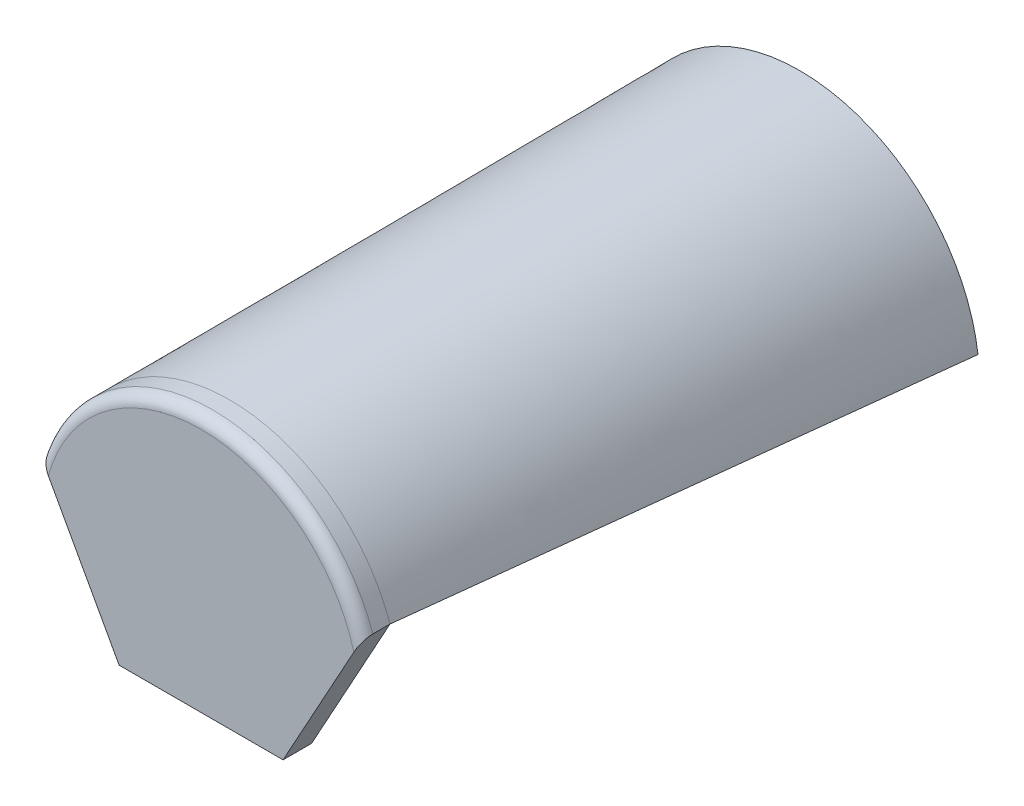
ISO-10303-21;
HEADER;
FILE_DESCRIPTION(('STEP AP214'),'2;1');
FILE_NAME('part.step','',(''),(''),'','','');
FILE_SCHEMA(('AUTOMOTIVE_DESIGN { 1 0 10303 214 1 1 1 1 }'));
ENDSEC;
DATA;
#1=APPLICATION_CONTEXT('core data for automotive mechanical design processes');
#2=APPLICATION_PROTOCOL_DEFINITION('international standard','automotive_design',2000,#1);
#3=PRODUCT_CONTEXT('',#1,'mechanical');
#4=PRODUCT('Part','Part','',(#3));
#5=PRODUCT_RELATED_PRODUCT_CATEGORY('part','',(#4));
#6=PRODUCT_DEFINITION_FORMATION('','',#4);
#7=PRODUCT_DEFINITION_CONTEXT('part definition',#1,'design');
#8=PRODUCT_DEFINITION('design','',#6,#7);
#9=PRODUCT_DEFINITION_SHAPE('','',#8);
#10=(LENGTH_UNIT() NAMED_UNIT(*) SI_UNIT(.MILLI.,.METRE.));
#11=(NAMED_UNIT(*) PLANE_ANGLE_UNIT() SI_UNIT($,.RADIAN.));
#12=(NAMED_UNIT(*) SI_UNIT($,.STERADIAN.) SOLID_ANGLE_UNIT());
#13=UNCERTAINTY_MEASURE_WITH_UNIT(LENGTH_MEASURE(1.E-05),#10,'distance_accuracy_value','');
#14=(GEOMETRIC_REPRESENTATION_CONTEXT(3) GLOBAL_UNCERTAINTY_ASSIGNED_CONTEXT((#13)) GLOBAL_UNIT_ASSIGNED_CONTEXT((#10,
#11,#12)) REPRESENTATION_CONTEXT('',''));
#15=CARTESIAN_POINT('',(0.,0.,0.));
#16=DIRECTION('',(0.,0.,1.));
#17=DIRECTION('',(1.,0.,0.));
#18=AXIS2_PLACEMENT_3D('',#15,#16,#17);
#19=CARTESIAN_POINT('',(112.5,-39.1015625,20.));
#20=DIRECTION('',(0.,0.,-1.));
#21=DIRECTION('',(-1.,0.,0.));
#22=AXIS2_PLACEMENT_3D('',#19,#20,#21);
#23=CYLINDRICAL_SURFACE('',#22,119.1015625);
#24=DIRECTION('',(0.,0.,-1.));
#25=VECTOR('',#24,1.);
#26=CARTESIAN_POINT('',(0.,0.,20.));
#27=LINE('',#26,#25);
#28=CARTESIAN_POINT('',(0.,0.,12.));
#29=VERTEX_POINT('',#28);
#30=CARTESIAN_POINT('',(0.,0.,0.));
#31=VERTEX_POINT('',#30);
#32=EDGE_CURVE('E186',#29,#31,#27,.T.);
#33=ORIENTED_EDGE('',*,*,#32,.F.);
#34=CARTESIAN_POINT('',(112.5,-39.1015625,12.));
#35=DIRECTION('',(0.,0.,1.));
#36=DIRECTION('',(1.,0.,0.));
#37=AXIS2_PLACEMENT_3D('',#34,#35,#36);
#38=CIRCLE('',#37,119.1015625);
#39=CARTESIAN_POINT('',(225.,0.,12.));
#40=VERTEX_POINT('',#39);
#41=EDGE_CURVE('E199',#29,#40,#38,.F.);
#42=ORIENTED_EDGE('',*,*,#41,.T.);
#43=DIRECTION('',(0.,0.,-1.));
#44=VECTOR('',#43,1.);
#45=CARTESIAN_POINT('',(225.,0.,20.));
#46=LINE('',#45,#44);
#47=CARTESIAN_POINT('',(225.,0.,0.));
#48=VERTEX_POINT('',#47);
#49=EDGE_CURVE('E238',#40,#48,#46,.T.);
#50=ORIENTED_EDGE('',*,*,#49,.T.);
#51=CARTESIAN_POINT('',(0.,0.,0.));
#52=CARTESIAN_POINT('',(2.07839183819702,5.97978870530225,0.));
#53=CARTESIAN_POINT('',(7.15585443542095,17.505489834182,0.));
#54=CARTESIAN_POINT('',(17.246802904265,33.1967274392337,0.));
#55=CARTESIAN_POINT('',(29.5252237566358,46.9949657129238,0.));
#56=CARTESIAN_POINT('',(43.6778356040351,58.6771621887305,0.));
#57=CARTESIAN_POINT('',(59.3913570579648,68.0202744001323,0.));
#58=CARTESIAN_POINT('',(76.3262132205491,74.8644422977581,0.));
#59=CARTESIAN_POINT('',(94.1428291939127,79.0498058322369,0.));
#60=CARTESIAN_POINT('',(106.364838123127,80.,0.));
#61=CARTESIAN_POINT('',(118.635161876873,80.,0.));
#62=CARTESIAN_POINT('',(130.857170806087,79.0498058322368,0.));
#63=CARTESIAN_POINT('',(148.673786779451,74.8644422977582,0.));
#64=CARTESIAN_POINT('',(165.608642942035,68.0202744001323,0.));
#65=CARTESIAN_POINT('',(181.322164395965,58.6771621887303,0.));
#66=CARTESIAN_POINT('',(195.474776243364,46.9949657129238,0.));
#67=CARTESIAN_POINT('',(207.753197095735,33.1967274392339,0.));
#68=CARTESIAN_POINT('',(217.844145564579,17.5054898341821,0.));
#69=CARTESIAN_POINT('',(222.921608161803,5.97978870530231,0.));
#70=CARTESIAN_POINT('',(225.,0.,0.));
#71=B_SPLINE_CURVE_WITH_KNOTS('',3,(#51,#52,#53,#54,#55,#56,#57,#58,#59,#60,#61,#62,#63,#64,#65,
#66,#67,#68,#69,#70),.UNSPECIFIED.,.F.,.F.,(4,1,1,1,1,1,1,1,2,1,1,1,1,1,1,1,4),
(0.472196875927689,0.505184571182208,0.538172266436728,0.571159961691247,0.604147656945766,
0.637135352200286,0.670123047454806,0.703110742709325,0.736098437963844,0.769086133218364,
0.802073828472883,0.835061523727403,0.868049218981922,0.901036914236442,0.934024609490961,
0.967012304745481,1.),.UNSPECIFIED.);
#72=EDGE_CURVE('E209',#31,#48,#71,.T.);
#73=ORIENTED_EDGE('',*,*,#72,.F.);
#74=EDGE_LOOP('',(#33,#42,#50,#73));
#75=FACE_BOUND('',#74,.T.);
#76=ADVANCED_FACE('F117',(#75),#23,.T.);
#77=CARTESIAN_POINT('',(125.048339300442,-227.360616909895,20.));
#78=DIRECTION('',(0.876215908676647,0.481918749772156,0.));
#79=DIRECTION('',(-0.481918749772156,0.876215908676647,0.));
#80=AXIS2_PLACEMENT_3D('',#77,#78,#79);
#81=PLANE('',#80);
#82=DIRECTION('',(0.481918749772156,-0.876215908676647,0.));
#83=VECTOR('',#82,1.);
#84=CARTESIAN_POINT('',(125.048339300442,-227.360616909895,20.));
#85=LINE('',#84,#83);
#86=CARTESIAN_POINT('',(5.35128993071741,-9.72961805584988,20.));
#87=VERTEX_POINT('',#86);
#88=CARTESIAN_POINT('',(55.,-100.,20.));
#89=VERTEX_POINT('',#88);
#90=EDGE_CURVE('E300',#87,#89,#85,.T.);
#91=ORIENTED_EDGE('',*,*,#90,.F.);
#92=CARTESIAN_POINT('',(5.35128993071746,-9.72961805584996,20.));
#93=CARTESIAN_POINT('',(5.24773831700359,-9.54134239455201,19.9999948468635));
#94=CARTESIAN_POINT('',(5.14419571928504,-9.35308312597283,19.9958015176348));
#95=CARTESIAN_POINT('',(4.93726336434831,-8.97684248063333,19.9788943481808));
#96=CARTESIAN_POINT('',(4.83387362173695,-8.78886113043085,19.9661797405239));
#97=CARTESIAN_POINT('',(4.52382094154683,-8.22512898463062,19.9149822010787));
#98=CARTESIAN_POINT('',(4.31761957422336,-7.85021740767886,19.8634445665284));
#99=CARTESIAN_POINT('',(3.90593070444048,-7.10169218989181,19.7233790808076));
#100=CARTESIAN_POINT('',(3.70047283637493,-6.72813242977261,19.6344727706198));
#101=CARTESIAN_POINT('',(3.29456787393649,-5.99012340715726,19.4178540558976));
#102=CARTESIAN_POINT('',(3.09411653378925,-5.62566642507138,19.2901758310271));
#103=CARTESIAN_POINT('',(2.63389097381173,-4.78889267965773,18.9436278711863));
#104=CARTESIAN_POINT('',(2.37683019530681,-4.32150944601247,18.7085310276124));
#105=CARTESIAN_POINT('',(2.00707048478377,-3.64921906324325,18.297178337406));
#106=CARTESIAN_POINT('',(1.88660850774248,-3.43019728680453,18.150514688658));
#107=CARTESIAN_POINT('',(1.65198716893388,-3.00361303442525,17.8369578205347));
#108=CARTESIAN_POINT('',(1.53782677440367,-2.79604868073397,17.6700679304398));
#109=CARTESIAN_POINT('',(1.25574199341425,-2.28316726075322,17.2166700856183));
#110=CARTESIAN_POINT('',(1.09319768213768,-1.98763214934126,16.9152297295147));
#111=CARTESIAN_POINT('',(0.868546806258631,-1.57917601137935,16.4257415925485));
#112=CARTESIAN_POINT('',(0.796848208182337,-1.44881492396791,16.2563296379588));
#113=CARTESIAN_POINT('',(0.660734360622805,-1.2013352011324,15.905274222154));
#114=CARTESIAN_POINT('',(0.59631765802406,-1.08421392368014,15.7236332128533));
#115=CARTESIAN_POINT('',(0.486661180244941,-0.884838509536282,15.3825745681249));
#116=CARTESIAN_POINT('',(0.440056562998183,-0.800102841814904,15.2250408579915));
#117=CARTESIAN_POINT('',(0.353022293832541,-0.64185871605919,14.90280272632));
#118=CARTESIAN_POINT('',(0.312591446234186,-0.568348084062181,14.7380997012301));
#119=CARTESIAN_POINT('',(0.238522588170953,-0.433677433038124,14.4025264193541));
#120=CARTESIAN_POINT('',(0.204874095537681,-0.372498355523085,14.2316661679716));
#121=CARTESIAN_POINT('',(0.14482228004107,-0.263313236438342,13.8846150290806));
#122=CARTESIAN_POINT('',(0.118417215590611,-0.2153040283466,13.7084254342738));
#123=CARTESIAN_POINT('',(0.064338272834196,-0.116978677880372,13.2809549326509));
#124=CARTESIAN_POINT('',(0.0403155675627584,-0.0733010319322752,13.0276095329003));
#125=CARTESIAN_POINT('',(0.0161832851292397,-0.029424154780438,12.6442782861125));
#126=CARTESIAN_POINT('',(0.0101227198397954,-0.018404945163281,12.5157844090989));
#127=CARTESIAN_POINT('',(0.00202938922336015,-0.00368979858796354,12.2582084485322));
#128=CARTESIAN_POINT('',(-2.01330743551814E-06,3.66055893293137E-06,12.1291261807569));
#129=CARTESIAN_POINT('',(0.,0.,12.));
#130=B_SPLINE_CURVE_WITH_KNOTS('',3,(#92,#93,#94,#95,#96,#97,#98,#99,#100,#101,#102,#103,#104,
#105,#106,#107,#108,#109,#110,#111,#112,#113,#114,#115,#116,#117,#118,#119,#120,#121,#122,#123,
#124,#125,#126,#127,#128,#129),.UNSPECIFIED.,.F.,.F.,(4,2,2,2,2,2,2,2,2,2,2,2,2,2,2,2,2,2,4),
(0.,0.644539303020679,1.28913666145139,2.58047293946303,3.88521520994636,5.18881059809758,
6.93068668050068,7.79927208999873,8.66771472226281,10.0187950056789,10.6945361902682,
11.3701422905433,11.9241555104032,12.478061297571,13.031104343079,13.5840142998736,
14.3562389968733,14.7433316537212,15.1305552158052),.UNSPECIFIED.);
#131=EDGE_CURVE('E13',#87,#29,#130,.T.);
#132=ORIENTED_EDGE('',*,*,#131,.T.);
#133=ORIENTED_EDGE('',*,*,#32,.T.);
#134=DIRECTION('',(0.481918749772156,-0.876215908676647,0.));
#135=VECTOR('',#134,1.);
#136=CARTESIAN_POINT('',(125.048339300442,-227.360616909895,0.));
#137=LINE('',#136,#135);
#138=CARTESIAN_POINT('',(55.,-100.,0.));
#139=VERTEX_POINT('',#138);
#140=EDGE_CURVE('E191',#31,#139,#137,.T.);
#141=ORIENTED_EDGE('',*,*,#140,.T.);
#142=DIRECTION('',(0.,0.,-1.));
#143=VECTOR('',#142,1.);
#144=CARTESIAN_POINT('',(55.,-100.,20.));
#145=LINE('',#144,#143);
#146=EDGE_CURVE('E200',#89,#139,#145,.T.);
#147=ORIENTED_EDGE('',*,*,#146,.F.);
#148=EDGE_LOOP('',(#91,#132,#133,#141,#147));
#149=FACE_BOUND('',#148,.T.);
#150=ADVANCED_FACE('F188',(#149),#81,.F.);
#151=CARTESIAN_POINT('',(112.5,-100.,20.));
#152=DIRECTION('',(0.,1.,0.));
#153=DIRECTION('',(-1.,0.,0.));
#154=AXIS2_PLACEMENT_3D('',#151,#152,#153);
#155=PLANE('',#154);
#156=DIRECTION('',(1.,0.,0.));
#157=VECTOR('',#156,1.);
#158=CARTESIAN_POINT('',(112.5,-100.,0.));
#159=LINE('',#158,#157);
#160=CARTESIAN_POINT('',(170.,-100.,0.));
#161=VERTEX_POINT('',#160);
#162=EDGE_CURVE('E234',#139,#161,#159,.T.);
#163=ORIENTED_EDGE('',*,*,#162,.T.);
#164=DIRECTION('',(0.,0.,-1.));
#165=VECTOR('',#164,1.);
#166=CARTESIAN_POINT('',(170.,-100.,20.));
#167=LINE('',#166,#165);
#168=CARTESIAN_POINT('',(170.,-100.,20.));
#169=VERTEX_POINT('',#168);
#170=EDGE_CURVE('E287',#169,#161,#167,.T.);
#171=ORIENTED_EDGE('',*,*,#170,.F.);
#172=DIRECTION('',(1.,0.,0.));
#173=VECTOR('',#172,1.);
#174=CARTESIAN_POINT('',(112.5,-100.,20.));
#175=LINE('',#174,#173);
#176=EDGE_CURVE('E296',#89,#169,#175,.T.);
#177=ORIENTED_EDGE('',*,*,#176,.F.);
#178=ORIENTED_EDGE('',*,*,#146,.T.);
#179=EDGE_LOOP('',(#163,#171,#177,#178));
#180=FACE_BOUND('',#179,.T.);
#181=ADVANCED_FACE('F258',(#180),#155,.F.);
#182=CARTESIAN_POINT('',(99.9516606995577,-227.360616909895,20.));
#183=DIRECTION('',(-0.876215908676647,0.481918749772156,0.));
#184=DIRECTION('',(-0.481918749772156,-0.876215908676647,0.));
#185=AXIS2_PLACEMENT_3D('',#182,#183,#184);
#186=PLANE('',#185);
#187=ORIENTED_EDGE('',*,*,#49,.F.);
#188=CARTESIAN_POINT('',(225.,0.,12.));
#189=CARTESIAN_POINT('',(225.00002729526,4.96277450210734E-05,12.1837292048694));
#190=CARTESIAN_POINT('',(224.995895277889,-0.0074631311112975,12.3674341778569));
#191=CARTESIAN_POINT('',(224.979517225964,-0.0372414073385935,12.7331697124156));
#192=CARTESIAN_POINT('',(224.967276206735,-0.059497805935594,12.9152012384841));
#193=CARTESIAN_POINT('',(224.935000867202,-0.118180241450575,13.2748956003537));
#194=CARTESIAN_POINT('',(224.915023273311,-0.154503139434915,13.4525804498395));
#195=CARTESIAN_POINT('',(224.867630514671,-0.240671791507457,13.8036328266673));
#196=CARTESIAN_POINT('',(224.840214557448,-0.290518986457642,13.9769998918479));
#197=CARTESIAN_POINT('',(224.778471121396,-0.402779779279776,14.3178390312922));
#198=CARTESIAN_POINT('',(224.744161064338,-0.465161701204205,14.485324739239));
#199=CARTESIAN_POINT('',(224.669082469646,-0.601668237007884,14.8140122625675));
#200=CARTESIAN_POINT('',(224.628311098853,-0.675798002085837,14.9752112825419));
#201=CARTESIAN_POINT('',(224.54080227156,-0.834904960800378,15.290765047917));
#202=CARTESIAN_POINT('',(224.494056471999,-0.919897323637391,15.4451098075194));
#203=CARTESIAN_POINT('',(224.39519295403,-1.09964917449013,15.746218116603));
#204=CARTESIAN_POINT('',(224.343074040982,-1.19441083457813,15.8929799691906));
#205=CARTESIAN_POINT('',(224.215028058028,-1.42722171267583,16.2282403302935));
#206=CARTESIAN_POINT('',(224.137124556855,-1.56886444208121,16.4135042983591));
#207=CARTESIAN_POINT('',(223.973808898308,-1.86580200307721,16.7691086594536));
#208=CARTESIAN_POINT('',(223.888394595042,-2.02110073628697,16.939444759547));
#209=CARTESIAN_POINT('',(223.62238609587,-2.50475255296359,17.4282125343114));
#210=CARTESIAN_POINT('',(223.432081807164,-2.85076035061148,17.72426243283));
#211=CARTESIAN_POINT('',(223.098453916193,-3.45735651601289,18.1707060078374));
#212=CARTESIAN_POINT('',(222.959940377063,-3.70919931443078,18.3371811484775));
#213=CARTESIAN_POINT('',(222.676445183614,-4.224645120701,18.6444795945051));
#214=CARTESIAN_POINT('',(222.53146410645,-4.48824707918197,18.7853051831454));
#215=CARTESIAN_POINT('',(222.236178119213,-5.02513069233987,19.0426234894347));
#216=CARTESIAN_POINT('',(222.08586051605,-5.298435425364,19.1590529142123));
#217=CARTESIAN_POINT('',(221.781480526259,-5.8518535886207,19.3681986807211));
#218=CARTESIAN_POINT('',(221.627418653728,-6.13196608413067,19.4609182579553));
#219=CARTESIAN_POINT('',(221.322604244533,-6.68617410084927,19.6204761510018));
#220=CARTESIAN_POINT('',(221.171956279295,-6.9600794921914,19.6881813235224));
#221=CARTESIAN_POINT('',(220.868871384933,-7.51114293648545,19.8033967110649));
#222=CARTESIAN_POINT('',(220.71643429641,-7.78830127925441,19.8509051124323));
#223=CARTESIAN_POINT('',(220.411671796624,-8.34241491522914,19.9260891795531));
#224=CARTESIAN_POINT('',(220.259355193133,-8.61935419430325,19.9539200169791));
#225=CARTESIAN_POINT('',(219.954256784498,-9.1740785736407,19.9908604719818));
#226=CARTESIAN_POINT('',(219.801475200229,-9.45186327231014,19.9999779041376));
#227=CARTESIAN_POINT('',(219.648710069283,-9.72961805584998,20.));
#228=B_SPLINE_CURVE_WITH_KNOTS('',3,(#188,#189,#190,#191,#192,#193,#194,#195,#196,#197,#198,
#199,#200,#201,#202,#203,#204,#205,#206,#207,#208,#209,#210,#211,#212,#213,#214,#215,#216,#217,
#218,#219,#220,#221,#222,#223,#224,#225,#226,#227),.UNSPECIFIED.,.F.,.F.,(4,2,2,2,2,2,2,2,2,2,2,
2,2,2,2,2,2,2,2,4),(0.,0.550949601498222,1.10155876466466,1.64820491871312,2.19490933465577,
2.74024919100848,3.28582883318996,3.83217885572897,4.37865061492477,5.1151628421397,
5.85188618421185,7.32587288828716,8.32123891284608,9.31651628930128,10.3143446667101,
11.3120368053,12.2708984176491,13.2298461168585,14.1811448422524,15.1320462314676),.UNSPECIFIED.);
#229=CARTESIAN_POINT('',(219.648710069283,-9.72961805584993,20.));
#230=VERTEX_POINT('',#229);
#231=EDGE_CURVE('E145',#40,#230,#228,.T.);
#232=ORIENTED_EDGE('',*,*,#231,.T.);
#233=DIRECTION('',(0.481918749772156,0.876215908676647,0.));
#234=VECTOR('',#233,1.);
#235=CARTESIAN_POINT('',(99.9516606995577,-227.360616909895,20.));
#236=LINE('',#235,#234);
#237=EDGE_CURVE('E293',#169,#230,#236,.T.);
#238=ORIENTED_EDGE('',*,*,#237,.F.);
#239=ORIENTED_EDGE('',*,*,#170,.T.);
#240=DIRECTION('',(0.481918749772156,0.876215908676647,0.));
#241=VECTOR('',#240,1.);
#242=CARTESIAN_POINT('',(99.9516606995577,-227.360616909895,0.));
#243=LINE('',#242,#241);
#244=EDGE_CURVE('E304',#161,#48,#243,.T.);
#245=ORIENTED_EDGE('',*,*,#244,.T.);
#246=EDGE_LOOP('',(#187,#232,#238,#239,#245));
#247=FACE_BOUND('',#246,.T.);
#248=ADVANCED_FACE('F261',(#247),#186,.F.);
#249=CARTESIAN_POINT('',(112.5,-234.262203525138,20.));
#250=DIRECTION('',(0.,0.,1.));
#251=DIRECTION('',(1.,0.,0.));
#252=AXIS2_PLACEMENT_3D('',#249,#250,#251);
#253=PLANE('',#252);
#254=ORIENTED_EDGE('',*,*,#237,.T.);
#255=CARTESIAN_POINT('',(112.5,-39.1015625,20.));
#256=DIRECTION('',(0.,0.,1.));
#257=DIRECTION('',(1.,0.,0.));
#258=AXIS2_PLACEMENT_3D('',#255,#256,#257);
#259=CIRCLE('',#258,111.1015625);
#260=EDGE_CURVE('E131',#230,#87,#259,.T.);
#261=ORIENTED_EDGE('',*,*,#260,.T.);
#262=ORIENTED_EDGE('',*,*,#90,.T.);
#263=ORIENTED_EDGE('',*,*,#176,.T.);
#264=EDGE_LOOP('',(#254,#261,#262,#263));
#265=FACE_BOUND('',#264,.T.);
#266=ADVANCED_FACE('F266',(#265),#253,.T.);
#267=CARTESIAN_POINT('',(112.5,-234.262203525138,0.));
#268=DIRECTION('',(0.,0.,1.));
#269=DIRECTION('',(1.,0.,0.));
#270=AXIS2_PLACEMENT_3D('',#267,#268,#269);
#271=PLANE('',#270);
#272=ORIENTED_EDGE('',*,*,#140,.F.);
#273=DIRECTION('',(-1.,0.,0.));
#274=VECTOR('',#273,1.);
#275=CARTESIAN_POINT('',(0.,0.,0.));
#276=LINE('',#275,#274);
#277=CARTESIAN_POINT('',(20.,0.,0.));
#278=VERTEX_POINT('',#277);
#279=EDGE_CURVE('E223',#278,#31,#276,.T.);
#280=ORIENTED_EDGE('',*,*,#279,.F.);
#281=CARTESIAN_POINT('',(205.,0.,0.));
#282=CARTESIAN_POINT('',(204.292734101681,1.30105188358215,0.));
#283=CARTESIAN_POINT('',(203.557916466552,2.58711628621563,0.));
#284=CARTESIAN_POINT('',(202.034715927114,5.1270384382844,0.));
#285=CARTESIAN_POINT('',(201.246335653934,6.38089776555002,0.));
#286=CARTESIAN_POINT('',(199.617501617874,8.85427084248644,0.));
#287=CARTESIAN_POINT('',(198.777049345731,10.0737855739354,0.));
#288=CARTESIAN_POINT('',(197.045552635588,12.4763284739052,0.));
#289=CARTESIAN_POINT('',(196.154508909974,13.6593571558302,0.));
#290=CARTESIAN_POINT('',(194.324022799921,15.9860280551084,0.));
#291=CARTESIAN_POINT('',(193.384614495264,17.1296970839876,0.));
#292=CARTESIAN_POINT('',(191.458442751736,19.3764128575376,0.));
#293=CARTESIAN_POINT('',(190.471679916823,20.4794601199803,0.));
#294=CARTESIAN_POINT('',(188.452324425883,22.6427834360559,0.));
#295=CARTESIAN_POINT('',(187.419731926554,23.703059635907,0.));
#296=CARTESIAN_POINT('',(185.310668004765,25.7790012737184,0.));
#297=CARTESIAN_POINT('',(184.234196089157,26.7946662100376,0.));
#298=CARTESIAN_POINT('',(181.673009332531,29.1112295361088,0.));
#299=CARTESIAN_POINT('',(180.171975050179,30.3941596995193,0.));
#300=CARTESIAN_POINT('',(177.100439084275,32.8738794662672,0.));
#301=CARTESIAN_POINT('',(175.529936223591,34.0706676090412,0.));
#302=CARTESIAN_POINT('',(172.324181607805,36.3743248514407,0.));
#303=CARTESIAN_POINT('',(170.68893086165,37.4811953514064,0.));
#304=CARTESIAN_POINT('',(168.191576992452,39.0708783388873,0.));
#305=CARTESIAN_POINT('',(167.351748193511,39.5889823543782,0.));
#306=CARTESIAN_POINT('',(165.657770324907,40.601234176705,0.));
#307=CARTESIAN_POINT('',(164.803621219401,41.095381923565,0.));
#308=CARTESIAN_POINT('',(162.220821899263,42.5413752024172,0.));
#309=CARTESIAN_POINT('',(160.47165247998,43.4568771752381,0.));
#310=CARTESIAN_POINT('',(156.924755901579,45.1882875769476,0.));
#311=CARTESIAN_POINT('',(155.127028501171,46.0041955108303,0.));
#312=CARTESIAN_POINT('',(151.94309981715,47.3429706434479,0.));
#313=CARTESIAN_POINT('',(150.566230509192,47.8881378084136,0.));
#314=CARTESIAN_POINT('',(147.790655776409,48.9200825401147,0.));
#315=CARTESIAN_POINT('',(146.391949037952,49.4068565787964,0.));
#316=CARTESIAN_POINT('',(143.575276554562,50.3209237791067,0.));
#317=CARTESIAN_POINT('',(142.157311314584,50.7482184969874,0.));
#318=CARTESIAN_POINT('',(139.304553507611,51.5422659221991,0.));
#319=CARTESIAN_POINT('',(137.869761233927,51.909019683142,0.));
#320=CARTESIAN_POINT('',(134.985751388001,52.5816456274665,0.));
#321=CARTESIAN_POINT('',(133.536531654965,52.8875085427114,0.));
#322=CARTESIAN_POINT('',(130.626489658203,53.4379457177351,0.));
#323=CARTESIAN_POINT('',(129.165667299517,53.6825194753628,0.));
#324=CARTESIAN_POINT('',(126.235028596747,54.1100230250837,0.));
#325=CARTESIAN_POINT('',(124.765212260737,54.2929528724995,0.));
#326=CARTESIAN_POINT('',(121.819202164927,54.5968160307377,0.));
#327=CARTESIAN_POINT('',(120.34300842719,54.7177495558663,0.));
#328=CARTESIAN_POINT('',(117.386838735763,54.8972626543874,0.));
#329=CARTESIAN_POINT('',(115.906862927695,54.9558445932891,0.));
#330=CARTESIAN_POINT('',(113.686130182396,54.9966836172857,0.));
#331=CARTESIAN_POINT('',(112.945738532153,55.0024571838996,0.));
#332=CARTESIAN_POINT('',(111.464995992194,54.998291677358,0.));
#333=CARTESIAN_POINT('',(110.724645102687,54.9883525299703,0.));
#334=CARTESIAN_POINT('',(108.504171641034,54.9350377092845,0.));
#335=CARTESIAN_POINT('',(107.024546075321,54.8681661619334,0.));
#336=CARTESIAN_POINT('',(104.069473605265,54.672122178551,0.));
#337=CARTESIAN_POINT('',(102.594026718349,54.5429494830933,0.));
#338=CARTESIAN_POINT('',(99.6500264043488,54.2226785643527,0.));
#339=CARTESIAN_POINT('',(98.1814722146275,54.0315873640726,0.));
#340=CARTESIAN_POINT('',(95.2537005083855,53.5878248230474,0.));
#341=CARTESIAN_POINT('',(93.7944829920383,53.3351534811582,0.));
#342=CARTESIAN_POINT('',(90.8879908698166,52.7685899895469,0.));
#343=CARTESIAN_POINT('',(89.4407161661953,52.4546983414062,0.));
#344=CARTESIAN_POINT('',(86.5607315882759,51.766014675722,0.));
#345=CARTESIAN_POINT('',(85.1280216533457,51.3912229118116,0.));
#346=CARTESIAN_POINT('',(82.281496163266,50.5817058619932,0.));
#347=CARTESIAN_POINT('',(80.8676599885314,50.1470530731359,0.));
#348=CARTESIAN_POINT('',(78.0595508364569,49.2185696596702,0.));
#349=CARTESIAN_POINT('',(76.6652779623245,48.7247387229944,0.));
#350=CARTESIAN_POINT('',(73.8987061564789,47.6789084782429,0.));
#351=CARTESIAN_POINT('',(72.5264074497846,47.1269085749459,0.));
#352=CARTESIAN_POINT('',(69.806199898169,45.9657719492819,0.));
#353=CARTESIAN_POINT('',(68.4582910452321,45.3566352456926,0.));
#354=CARTESIAN_POINT('',(65.7888616748569,44.0820437757102,0.));
#355=CARTESIAN_POINT('',(64.4673493349871,43.4165718812892,0.));
#356=CARTESIAN_POINT('',(61.8535368538967,42.0304985662644,0.));
#357=CARTESIAN_POINT('',(60.5612370594709,41.3098964916308,0.));
#358=CARTESIAN_POINT('',(58.0083420031801,39.8145612676279,0.));
#359=CARTESIAN_POINT('',(56.7477465584896,39.0398284305047,0.));
#360=CARTESIAN_POINT('',(54.2604995319946,37.4378906795809,0.));
#361=CARTESIAN_POINT('',(53.0338459994513,36.6106887903603,0.));
#362=CARTESIAN_POINT('',(50.2122039202899,34.6202653454326,0.));
#363=CARTESIAN_POINT('',(48.6311781302475,33.4371627153768,0.));
#364=CARTESIAN_POINT('',(45.5378952662055,30.9842484505889,0.));
#365=CARTESIAN_POINT('',(44.0256411482865,29.7144330944559,0.));
#366=CARTESIAN_POINT('',(41.0745005764995,27.0917208973305,0.));
#367=CARTESIAN_POINT('',(39.6356219154813,25.7388152652206,0.));
#368=CARTESIAN_POINT('',(37.5372328408266,23.6512266981152,0.));
#369=CARTESIAN_POINT('',(36.8481239560418,22.9460664491581,0.));
#370=CARTESIAN_POINT('',(35.4900906302526,21.5165691348735,0.));
#371=CARTESIAN_POINT('',(34.8211661573565,20.792232099849,0.));
#372=CARTESIAN_POINT('',(32.8455663493898,18.5916337156154,0.));
#373=CARTESIAN_POINT('',(31.5697517988667,17.0874737689241,0.));
#374=CARTESIAN_POINT('',(29.1050670842583,14.0107172439376,0.));
#375=CARTESIAN_POINT('',(27.9161559033084,12.4381535174196,0.));
#376=CARTESIAN_POINT('',(26.1532730297922,9.96532243761093,0.));
#377=CARTESIAN_POINT('',(25.5474252370656,9.08761866215389,0.));
#378=CARTESIAN_POINT('',(24.3627427267948,7.31442004000325,0.));
#379=CARTESIAN_POINT('',(23.783901904395,6.41892927990347,0.));
#380=CARTESIAN_POINT('',(22.6546572626132,4.61237971013471,0.));
#381=CARTESIAN_POINT('',(22.1042054655877,3.701350876788,0.));
#382=CARTESIAN_POINT('',(21.0310864048346,1.86279906840173,0.));
#383=CARTESIAN_POINT('',(20.5084254228934,0.935272426924285,0.));
#384=CARTESIAN_POINT('',(20.,0.,0.));
#385=B_SPLINE_CURVE_WITH_KNOTS('',3,(#281,#282,#283,#284,#285,#286,#287,#288,#289,#290,#291,
#292,#293,#294,#295,#296,#297,#298,#299,#300,#301,#302,#303,#304,#305,#306,#307,#308,#309,#310,
#311,#312,#313,#314,#315,#316,#317,#318,#319,#320,#321,#322,#323,#324,#325,#326,#327,#328,#329,
#330,#331,#332,#333,#334,#335,#336,#337,#338,#339,#340,#341,#342,#343,#344,#345,#346,#347,#348,
#349,#350,#351,#352,#353,#354,#355,#356,#357,#358,#359,#360,#361,#362,#363,#364,#365,#366,#367,
#368,#369,#370,#371,#372,#373,#374,#375,#376,#377,#378,#379,#380,#381,#382,#383,#384),
.UNSPECIFIED.,.F.,.F.,(4,2,2,2,2,2,2,2,2,2,2,2,2,2,2,2,2,2,2,2,2,2,2,2,2,2,2,2,2,2,2,2,2,2,2,2,
2,2,2,2,2,2,2,2,2,2,2,2,2,2,2,4),(0.,4.44225065939855,8.8842832618771,13.326188754797,
17.7680317160288,22.2067864941796,26.645484675625,31.0841676815409,35.5229005864147,
41.4434100708633,47.3640199156756,53.2845375376761,56.2445529198317,59.2045757121641,
65.1240276025287,71.043508912776,75.484876483915,79.9265122629793,84.3680318066006,
88.8094740450188,93.2515917950505,97.693745938817,102.13589609595,106.578030897557,
111.019997166395,113.241095617607,115.462204562088,119.904176008957,124.346165952678,
128.787652247389,133.229138624628,137.670588614037,142.11202010643,146.548119170597,
150.984241628929,155.420409484867,159.856575882884,164.294095920911,168.731668611045,
173.16921570574,177.606507229963,183.527289984112,189.448326997032,195.369991550347,
198.327541640274,201.285087056982,207.198855799998,213.109815079554,216.30888364907,
219.507225538732,222.699972075316,225.893437253181),.UNSPECIFIED.);
#386=CARTESIAN_POINT('',(205.,0.,0.));
#387=VERTEX_POINT('',#386);
#388=EDGE_CURVE('E229',#387,#278,#385,.T.);
#389=ORIENTED_EDGE('',*,*,#388,.F.);
#390=DIRECTION('',(-1.,0.,0.));
#391=VECTOR('',#390,1.);
#392=CARTESIAN_POINT('',(225.,0.,0.));
#393=LINE('',#392,#391);
#394=EDGE_CURVE('E318',#48,#387,#393,.T.);
#395=ORIENTED_EDGE('',*,*,#394,.F.);
#396=ORIENTED_EDGE('',*,*,#244,.F.);
#397=ORIENTED_EDGE('',*,*,#162,.F.);
#398=EDGE_LOOP('',(#272,#280,#389,#395,#396,#397));
#399=FACE_BOUND('',#398,.T.);
#400=ADVANCED_FACE('F232',(#399),#271,.F.);
#401=CARTESIAN_POINT('',(112.5,-46.0227272727272,-400.));
#402=DIRECTION('',(0.,0.,1.));
#403=DIRECTION('',(1.,0.,0.));
#404=AXIS2_PLACEMENT_3D('',#401,#402,#403);
#405=PLANE('',#404);
#406=CARTESIAN_POINT('',(112.5,-46.0227272727272,-400.));
#407=DIRECTION('',(0.,0.,1.));
#408=DIRECTION('',(1.,0.,0.));
#409=AXIS2_PLACEMENT_3D('',#406,#407,#408);
#410=CIRCLE('',#409,126.022727272727);
#411=CARTESIAN_POINT('',(237.5,-29.9999999999999,-400.));
#412=VERTEX_POINT('',#411);
#413=CARTESIAN_POINT('',(-12.5,-30.,-400.));
#414=VERTEX_POINT('',#413);
#415=EDGE_CURVE('E213',#412,#414,#410,.T.);
#416=ORIENTED_EDGE('',*,*,#415,.F.);
#417=DIRECTION('',(1.,0.,0.));
#418=VECTOR('',#417,1.);
#419=CARTESIAN_POINT('',(237.5,-29.9999999999999,-400.));
#420=LINE('',#419,#418);
#421=CARTESIAN_POINT('',(225.5,-30.,-400.));
#422=VERTEX_POINT('',#421);
#423=EDGE_CURVE('E334',#422,#412,#420,.T.);
#424=ORIENTED_EDGE('',*,*,#423,.F.);
#425=CARTESIAN_POINT('',(112.5,-66.8597560975572,-400.));
#426=DIRECTION('',(0.,0.,-1.));
#427=DIRECTION('',(1.,0.,0.));
#428=AXIS2_PLACEMENT_3D('',#425,#426,#427);
#429=CIRCLE('',#428,118.85975609756);
#430=CARTESIAN_POINT('',(-0.500000000000014,-30.,-400.));
#431=VERTEX_POINT('',#430);
#432=EDGE_CURVE('E339',#431,#422,#429,.T.);
#433=ORIENTED_EDGE('',*,*,#432,.F.);
#434=DIRECTION('',(1.,0.,0.));
#435=VECTOR('',#434,1.);
#436=CARTESIAN_POINT('',(-0.500000000000011,-30.,-400.));
#437=LINE('',#436,#435);
#438=EDGE_CURVE('E344',#414,#431,#437,.T.);
#439=ORIENTED_EDGE('',*,*,#438,.F.);
#440=EDGE_LOOP('',(#416,#424,#433,#439));
#441=FACE_BOUND('',#440,.T.);
#442=ADVANCED_FACE('F364',(#441),#405,.F.);
#443=CARTESIAN_POINT('',(0.,0.,0.));
#444=CARTESIAN_POINT('',(-4.16666666666671,-9.99999999999997,-133.333333333333));
#445=CARTESIAN_POINT('',(-8.33333333333337,-20.,-266.666666666667));
#446=CARTESIAN_POINT('',(-12.5,-30.,-400.));
#447=CARTESIAN_POINT('',(2.07839183819702,5.97978870530225,0.));
#448=CARTESIAN_POINT('',(-2.47002808910668,-3.58688965293191,-133.333333333333));
#449=CARTESIAN_POINT('',(-7.01844801641038,-13.1535680111661,-266.666666666667));
#450=CARTESIAN_POINT('',(-11.5668679437141,-22.7202463694003,-400.));
#451=CARTESIAN_POINT('',(7.15585443542095,17.505489834182,0.));
#452=CARTESIAN_POINT('',(1.96709372294924,8.93322224262662,-133.333333333333));
#453=CARTESIAN_POINT('',(-3.22166698952248,0.360954651071236,-266.666666666666));
#454=CARTESIAN_POINT('',(-8.41042770199419,-8.21131294048415,-400.));
#455=CARTESIAN_POINT('',(17.246802904265,33.1967274392337,0.));
#456=CARTESIAN_POINT('',(11.564910755845,26.3461570887803,-133.333333333334));
#457=CARTESIAN_POINT('',(5.88301860742502,19.4955867383269,-266.666666666667));
#458=CARTESIAN_POINT('',(0.201126459005043,12.6450163878734,-400.000000000001));
#459=CARTESIAN_POINT('',(29.5252237566358,46.9949657129238,0.));
#460=CARTESIAN_POINT('',(23.85746930806,41.9385993381897,-133.333333333333));
#461=CARTESIAN_POINT('',(18.1897148594841,36.8822329634556,-266.666666666666));
#462=CARTESIAN_POINT('',(12.5219604109083,31.8258665887215,-399.999999999999));
#463=CARTESIAN_POINT('',(43.6778356040351,58.6771621887305,0.));
#464=CARTESIAN_POINT('',(38.5217666059876,55.3176244659455,-133.333333333334));
#465=CARTESIAN_POINT('',(33.3656976079401,51.9580867431604,-266.666666666667));
#466=CARTESIAN_POINT('',(28.2096286098926,48.5985490203754,-400.000000000001));
#467=CARTESIAN_POINT('',(59.3913570579648,68.0202744001323,0.));
#468=CARTESIAN_POINT('',(55.1789811745852,66.1176768007915,-133.333333333333));
#469=CARTESIAN_POINT('',(50.9666052912057,64.2150792014508,-266.666666666666));
#470=CARTESIAN_POINT('',(46.7542294078261,62.31248160211,-399.999999999999));
#471=CARTESIAN_POINT('',(76.3262132205491,74.8644422977581,0.));
#472=CARTESIAN_POINT('',(73.3853464679876,74.0573361913212,-133.333333333333));
#473=CARTESIAN_POINT('',(70.444479715426,73.2502300848844,-266.666666666667));
#474=CARTESIAN_POINT('',(67.5036129628645,72.4431239784475,-400.));
#475=CARTESIAN_POINT('',(94.1428291939127,79.0498058322369,0.));
#476=CARTESIAN_POINT('',(92.6622692834494,78.909220631146,-133.333333333333));
#477=CARTESIAN_POINT('',(91.1817093729861,78.7686354300551,-266.666666666667));
#478=CARTESIAN_POINT('',(89.7011494625228,78.6280502289642,-400.));
#479=CARTESIAN_POINT('',(106.364838123127,80.,0.));
#480=CARTESIAN_POINT('',(105.883644535992,80.,-133.333333333333));
#481=CARTESIAN_POINT('',(105.402450948856,80.,-266.666666666667));
#482=CARTESIAN_POINT('',(104.92125736172,80.,-400.));
#483=CARTESIAN_POINT('',(118.635161876873,80.,0.));
#484=CARTESIAN_POINT('',(119.116355464008,80.,-133.333333333333));
#485=CARTESIAN_POINT('',(119.597549051144,80.,-266.666666666667));
#486=CARTESIAN_POINT('',(120.07874263828,80.,-400.));
#487=CARTESIAN_POINT('',(130.857170806087,79.0498058322368,0.));
#488=CARTESIAN_POINT('',(132.337730716551,78.9092206311459,-133.333333333333));
#489=CARTESIAN_POINT('',(133.818290627015,78.7686354300549,-266.666666666667));
#490=CARTESIAN_POINT('',(135.298850537478,78.628050228964,-400.));
#491=CARTESIAN_POINT('',(148.673786779451,74.8644422977582,0.));
#492=CARTESIAN_POINT('',(151.614653532012,74.0573361913214,-133.333333333333));
#493=CARTESIAN_POINT('',(154.555520284574,73.2502300848846,-266.666666666667));
#494=CARTESIAN_POINT('',(157.496387037135,72.4431239784477,-400.));
#495=CARTESIAN_POINT('',(165.608642942035,68.0202744001323,0.));
#496=CARTESIAN_POINT('',(169.821018825415,66.1176768007914,-133.333333333333));
#497=CARTESIAN_POINT('',(174.033394708795,64.2150792014505,-266.666666666667));
#498=CARTESIAN_POINT('',(178.245770592175,62.3124816021097,-400.000000000001));
#499=CARTESIAN_POINT('',(181.322164395965,58.6771621887303,0.));
#500=CARTESIAN_POINT('',(186.478233394012,55.3176244659455,-133.333333333333));
#501=CARTESIAN_POINT('',(191.634302392059,51.9580867431606,-266.666666666666));
#502=CARTESIAN_POINT('',(196.790371390106,48.5985490203757,-399.999999999999));
#503=CARTESIAN_POINT('',(195.474776243364,46.9949657129238,0.));
#504=CARTESIAN_POINT('',(201.14253069194,41.9385993381896,-133.333333333333));
#505=CARTESIAN_POINT('',(206.810285140516,36.8822329634555,-266.666666666667));
#506=CARTESIAN_POINT('',(212.478039589093,31.8258665887214,-400.));
#507=CARTESIAN_POINT('',(207.753197095735,33.1967274392339,0.));
#508=CARTESIAN_POINT('',(213.435089244155,26.3461570887804,-133.333333333333));
#509=CARTESIAN_POINT('',(219.116981392575,19.495586738327,-266.666666666667));
#510=CARTESIAN_POINT('',(224.798873540995,12.6450163878735,-400.));
#511=CARTESIAN_POINT('',(217.844145564579,17.5054898341821,0.));
#512=CARTESIAN_POINT('',(223.032906277051,8.93322224262671,-133.333333333333));
#513=CARTESIAN_POINT('',(228.221666989522,0.360954651071285,-266.666666666666));
#514=CARTESIAN_POINT('',(233.410427701994,-8.21131294048413,-399.999999999999));
#515=CARTESIAN_POINT('',(222.921608161803,5.97978870530231,0.));
#516=CARTESIAN_POINT('',(227.470028089107,-3.58688965293185,-133.333333333333));
#517=CARTESIAN_POINT('',(232.01844801641,-13.153568011166,-266.666666666667));
#518=CARTESIAN_POINT('',(236.566867943714,-22.7202463694002,-400.));
#519=CARTESIAN_POINT('',(225.,0.,0.));
#520=CARTESIAN_POINT('',(229.166666666667,-9.99999999999991,-133.333333333333));
#521=CARTESIAN_POINT('',(233.333333333333,-19.9999999999999,-266.666666666667));
#522=CARTESIAN_POINT('',(237.5,-29.9999999999999,-400.));
#523=B_SPLINE_SURFACE_WITH_KNOTS('',3,3,((#443,#444,#445,#446),(#447,#448,#449,#450),(#451,#452,
#453,#454),(#455,#456,#457,#458),(#459,#460,#461,#462),(#463,#464,#465,#466),(#467,#468,#469,
#470),(#471,#472,#473,#474),(#475,#476,#477,#478),(#479,#480,#481,#482),(#483,#484,#485,#486),
(#487,#488,#489,#490),(#491,#492,#493,#494),(#495,#496,#497,#498),(#499,#500,#501,#502),(#503,
#504,#505,#506),(#507,#508,#509,#510),(#511,#512,#513,#514),(#515,#516,#517,#518),(#519,#520,
#521,#522)),.UNSPECIFIED.,.F.,.F.,.F.,(4,1,1,1,1,1,1,1,2,1,1,1,1,1,1,1,4),(4,4),
(0.472196875927689,0.505184571182208,0.538172266436728,0.571159961691247,0.604147656945766,
0.637135352200286,0.670123047454806,0.703110742709325,0.736098437963844,0.769086133218364,
0.802073828472883,0.835061523727403,0.868049218981922,0.901036914236442,0.934024609490961,
0.967012304745481,1.),(0.,1.),.UNSPECIFIED.);
#524=CARTESIAN_POINT('',(225.,0.,0.));
#525=CARTESIAN_POINT('',(229.166666666667,-9.99999999999991,-133.333333333333));
#526=CARTESIAN_POINT('',(233.333333333333,-19.9999999999999,-266.666666666667));
#527=CARTESIAN_POINT('',(237.5,-29.9999999999999,-400.));
#528=B_SPLINE_CURVE_WITH_KNOTS('',3,(#524,#525,#526,#527),.UNSPECIFIED.,.F.,.F.,(4,4),(0.,1.),.UNSPECIFIED.);
#529=EDGE_CURVE('E218',#48,#412,#528,.T.);
#530=CARTESIAN_POINT('',(0.,0.,0.));
#531=CARTESIAN_POINT('',(-4.16666666666671,-9.99999999999997,-133.333333333333));
#532=CARTESIAN_POINT('',(-8.33333333333337,-20.,-266.666666666667));
#533=CARTESIAN_POINT('',(-12.5,-30.,-400.));
#534=B_SPLINE_CURVE_WITH_KNOTS('',3,(#530,#531,#532,#533),.UNSPECIFIED.,.F.,.F.,(4,4),(0.,1.),.UNSPECIFIED.);
#535=EDGE_CURVE('E206',#31,#414,#534,.T.);
#536=ORIENTED_EDGE('',*,*,#72,.T.);
#537=ORIENTED_EDGE('',*,*,#529,.T.);
#538=ORIENTED_EDGE('',*,*,#415,.T.);
#539=ORIENTED_EDGE('',*,*,#535,.F.);
#540=EDGE_LOOP('',(#536,#537,#538,#539));
#541=FACE_BOUND('',#540,.T.);
#542=ADVANCED_FACE('F208',(#541),#523,.T.);
#543=CARTESIAN_POINT('',(20.,0.,0.));
#544=DIRECTION('',(0.,-0.997199309888456,0.0747899482416343));
#545=DIRECTION('',(-1.,0.,0.));
#546=AXIS2_PLACEMENT_3D('',#543,#544,#545);
#547=PLANE('',#546);
#548=ORIENTED_EDGE('',*,*,#279,.T.);
#549=ORIENTED_EDGE('',*,*,#535,.T.);
#550=ORIENTED_EDGE('',*,*,#438,.T.);
#551=CARTESIAN_POINT('',(20.,0.,0.));
#552=CARTESIAN_POINT('',(13.1666666666666,-10.,-133.333333333333));
#553=CARTESIAN_POINT('',(6.33333333333332,-20.,-266.666666666667));
#554=CARTESIAN_POINT('',(-0.500000000000014,-30.,-400.));
#555=B_SPLINE_CURVE_WITH_KNOTS('',3,(#551,#552,#553,#554),.UNSPECIFIED.,.F.,.F.,(4,4),(0.,1.),.UNSPECIFIED.);
#556=EDGE_CURVE('E219',#278,#431,#555,.T.);
#557=ORIENTED_EDGE('',*,*,#556,.F.);
#558=EDGE_LOOP('',(#548,#549,#550,#557));
#559=FACE_BOUND('',#558,.T.);
#560=ADVANCED_FACE('F224',(#559),#547,.T.);
#561=CARTESIAN_POINT('',(205.,0.,0.));
#562=CARTESIAN_POINT('',(211.833333333333,-9.99999999999997,-133.333333333333));
#563=CARTESIAN_POINT('',(218.666666666667,-19.9999999999999,-266.666666666667));
#564=CARTESIAN_POINT('',(225.5,-29.9999999999999,-400.));
#565=CARTESIAN_POINT('',(202.752152576259,4.13502328344709,0.));
#566=CARTESIAN_POINT('',(209.692033456044,-5.27290198174023,-133.333333333333));
#567=CARTESIAN_POINT('',(216.631914335828,-14.6808272469275,-266.666666666667));
#568=CARTESIAN_POINT('',(223.571795215613,-24.0887525121149,-400.));
#569=CARTESIAN_POINT('',(197.700005971288,12.1020930937702,0.));
#570=CARTESIAN_POINT('',(204.728667507616,3.87823113456308,-133.333333333333));
#571=CARTESIAN_POINT('',(211.757329043943,-4.34563082464407,-266.666666666666));
#572=CARTESIAN_POINT('',(218.78599058027,-12.5694927838512,-399.999999999999));
#573=CARTESIAN_POINT('',(188.595829126016,22.936395508497,0.));
#574=CARTESIAN_POINT('',(195.395402518656,16.4159238404793,-133.333333333334));
#575=CARTESIAN_POINT('',(202.194975911296,9.89545217246159,-266.666666666668));
#576=CARTESIAN_POINT('',(208.994549303937,3.37498050444389,-400.000000000002));
#577=CARTESIAN_POINT('',(178.119782777425,32.4501963155507,0.));
#578=CARTESIAN_POINT('',(184.357063432817,27.4978745491207,-133.333333333333));
#579=CARTESIAN_POINT('',(190.594344088209,22.5455527826906,-266.666666666666));
#580=CARTESIAN_POINT('',(196.831624743601,17.5932310162606,-399.999999999999));
#581=CARTESIAN_POINT('',(166.470863921768,40.484984803616,0.));
#582=CARTESIAN_POINT('',(171.845864706672,36.9019084244386,-133.333333333334));
#583=CARTESIAN_POINT('',(177.220865491576,33.3188320452612,-266.666666666667));
#584=CARTESIAN_POINT('',(182.59586627648,29.7357556660838,-400.000000000001));
#585=CARTESIAN_POINT('',(153.848069555297,46.8822502613776,0.));
#586=CARTESIAN_POINT('',(158.111153655411,44.4228777642884,-133.333333333333));
#587=CARTESIAN_POINT('',(162.374237755526,41.9635052671991,-266.666666666666));
#588=CARTESIAN_POINT('',(166.637321855641,39.5041327701098,-399.999999999999));
#589=CARTESIAN_POINT('',(140.48597828471,51.5423847720307,0.));
#590=CARTESIAN_POINT('',(143.440032465423,49.9143427255173,-133.333333333333));
#591=CARTESIAN_POINT('',(146.394086646136,48.2863006790039,-266.666666666667));
#592=CARTESIAN_POINT('',(149.348140826849,46.6582586324904,-400.));
#593=CARTESIAN_POINT('',(126.619168716709,54.3657804187702,0.));
#594=CARTESIAN_POINT('',(128.130548347855,53.2512878741653,-133.333333333333));
#595=CARTESIAN_POINT('',(129.641927979,52.1367953295603,-266.666666666667));
#596=CARTESIAN_POINT('',(131.153307610146,51.0223027849554,-400.));
#597=CARTESIAN_POINT('',(112.5,55.3182935261616,0.));
#598=CARTESIAN_POINT('',(112.5,54.3751955413274,-133.333333333333));
#599=CARTESIAN_POINT('',(112.5,53.4320975564932,-266.666666666666));
#600=CARTESIAN_POINT('',(112.5,52.488999571659,-399.999999999999));
#601=CARTESIAN_POINT('',(98.3808312832907,54.3657804187702,0.));
#602=CARTESIAN_POINT('',(96.8694516521451,53.2512878741652,-133.333333333334));
#603=CARTESIAN_POINT('',(95.3580720209994,52.1367953295602,-266.666666666668));
#604=CARTESIAN_POINT('',(93.8466923898538,51.0223027849552,-400.000000000001));
#605=CARTESIAN_POINT('',(84.5140217152888,51.5423847720307,0.));
#606=CARTESIAN_POINT('',(81.559967534576,49.9143427255173,-133.333333333333));
#607=CARTESIAN_POINT('',(78.6059133538631,48.286300679004,-266.666666666665));
#608=CARTESIAN_POINT('',(75.6518591731503,46.6582586324906,-399.999999999997));
#609=CARTESIAN_POINT('',(71.1519304447033,46.8822502613775,0.));
#610=CARTESIAN_POINT('',(66.8888463445887,44.4228777642882,-133.333333333334));
#611=CARTESIAN_POINT('',(62.6257622444741,41.9635052671989,-266.666666666668));
#612=CARTESIAN_POINT('',(58.3626781443596,39.5041327701096,-400.000000000002));
#613=CARTESIAN_POINT('',(58.5291360782325,40.4849848036158,0.));
#614=CARTESIAN_POINT('',(53.154135293328,36.9019084244385,-133.333333333333));
#615=CARTESIAN_POINT('',(47.7791345084236,33.3188320452611,-266.666666666666));
#616=CARTESIAN_POINT('',(42.4041337235192,29.7357556660838,-399.999999999999));
#617=CARTESIAN_POINT('',(46.8802172225746,32.4501963155507,0.));
#618=CARTESIAN_POINT('',(40.6429365671827,27.4978745491206,-133.333333333334));
#619=CARTESIAN_POINT('',(34.4056559117908,22.5455527826905,-266.666666666667));
#620=CARTESIAN_POINT('',(28.1683752563989,17.5932310162604,-400.000000000001));
#621=CARTESIAN_POINT('',(36.4041708739835,22.9363955084971,0.));
#622=CARTESIAN_POINT('',(29.6045974813434,16.4159238404794,-133.333333333333));
#623=CARTESIAN_POINT('',(22.8050240887032,9.89545217246171,-266.666666666666));
#624=CARTESIAN_POINT('',(16.005450696063,3.37498050444401,-399.999999999999));
#625=CARTESIAN_POINT('',(27.2999940287131,12.1020930937701,0.));
#626=CARTESIAN_POINT('',(20.2713324923855,3.87823113456299,-133.333333333334));
#627=CARTESIAN_POINT('',(13.2426709560579,-4.34563082464413,-266.666666666667));
#628=CARTESIAN_POINT('',(6.21400941973038,-12.5694927838513,-400.000000000001));
#629=CARTESIAN_POINT('',(22.2478474237412,4.13502328344709,0.));
#630=CARTESIAN_POINT('',(15.3079665439565,-5.27290198174026,-133.333333333333));
#631=CARTESIAN_POINT('',(8.36808566417177,-14.6808272469276,-266.666666666667));
#632=CARTESIAN_POINT('',(1.42820478438705,-24.088752512115,-400.));
#633=CARTESIAN_POINT('',(20.,0.,0.));
#634=CARTESIAN_POINT('',(13.1666666666666,-10.,-133.333333333333));
#635=CARTESIAN_POINT('',(6.33333333333332,-20.,-266.666666666667));
#636=CARTESIAN_POINT('',(-0.500000000000014,-30.,-400.));
#637=B_SPLINE_SURFACE_WITH_KNOTS('',3,3,((#561,#562,#563,#564),(#565,#566,#567,#568),(#569,#570,
#571,#572),(#573,#574,#575,#576),(#577,#578,#579,#580),(#581,#582,#583,#584),(#585,#586,#587,
#588),(#589,#590,#591,#592),(#593,#594,#595,#596),(#597,#598,#599,#600),(#601,#602,#603,#604),
(#605,#606,#607,#608),(#609,#610,#611,#612),(#613,#614,#615,#616),(#617,#618,#619,#620),(#621,
#622,#623,#624),(#625,#626,#627,#628),(#629,#630,#631,#632),(#633,#634,#635,#636)),
.UNSPECIFIED.,.F.,.F.,.F.,(4,1,1,1,1,1,1,1,1,1,1,1,1,1,1,1,4),(4,4),(0.0265877721046975,
0.0527766053370909,0.0789654385694842,0.105154271801878,0.131343105034271,0.157531938266664,
0.183720771499058,0.209909604731451,0.236098437963844,0.262287271196238,0.288476104428631,
0.314664937661024,0.340853770893418,0.367042604125811,0.393231437358205,0.419420270590598,
0.445609103822991),(0.,1.),.UNSPECIFIED.);
#638=CARTESIAN_POINT('',(205.,0.,0.));
#639=CARTESIAN_POINT('',(211.833333333333,-9.99999999999997,-133.333333333333));
#640=CARTESIAN_POINT('',(218.666666666667,-19.9999999999999,-266.666666666667));
#641=CARTESIAN_POINT('',(225.5,-29.9999999999999,-400.));
#642=B_SPLINE_CURVE_WITH_KNOTS('',3,(#638,#639,#640,#641),.UNSPECIFIED.,.F.,.F.,(4,4),(0.,1.),.UNSPECIFIED.);
#643=EDGE_CURVE('E329',#387,#422,#642,.T.);
#644=ORIENTED_EDGE('',*,*,#388,.T.);
#645=ORIENTED_EDGE('',*,*,#556,.T.);
#646=ORIENTED_EDGE('',*,*,#432,.T.);
#647=ORIENTED_EDGE('',*,*,#643,.F.);
#648=EDGE_LOOP('',(#644,#645,#646,#647));
#649=FACE_BOUND('',#648,.T.);
#650=ADVANCED_FACE('F429',(#649),#637,.T.);
#651=CARTESIAN_POINT('',(225.,0.,0.));
#652=DIRECTION('',(0.,-0.997199309888456,0.0747899482416343));
#653=DIRECTION('',(-1.,0.,0.));
#654=AXIS2_PLACEMENT_3D('',#651,#652,#653);
#655=PLANE('',#654);
#656=ORIENTED_EDGE('',*,*,#394,.T.);
#657=ORIENTED_EDGE('',*,*,#643,.T.);
#658=ORIENTED_EDGE('',*,*,#423,.T.);
#659=ORIENTED_EDGE('',*,*,#529,.F.);
#660=EDGE_LOOP('',(#656,#657,#658,#659));
#661=FACE_BOUND('',#660,.T.);
#662=ADVANCED_FACE('F374',(#661),#655,.T.);
#663=CARTESIAN_POINT('',(112.5,-39.1015625,12.));
#664=DIRECTION('',(0.,0.,1.));
#665=DIRECTION('',(1.,0.,0.));
#666=AXIS2_PLACEMENT_3D('',#663,#664,#665);
#667=TOROIDAL_SURFACE('',#666,111.1015625,8.);
#668=ORIENTED_EDGE('',*,*,#131,.F.);
#669=ORIENTED_EDGE('',*,*,#260,.F.);
#670=ORIENTED_EDGE('',*,*,#231,.F.);
#671=ORIENTED_EDGE('',*,*,#41,.F.);
#672=EDGE_LOOP('',(#668,#669,#670,#671));
#673=FACE_BOUND('',#672,.T.);
#674=ADVANCED_FACE('F119',(#673),#667,.T.);
#675=CLOSED_SHELL('',(#76,#150,#181,#248,#266,#400,#442,#542,#560,#650,#662,#674));
#676=MANIFOLD_SOLID_BREP('B2',#675);
#677=ADVANCED_BREP_SHAPE_REPRESENTATION('',(#18,#676),#14);
#678=SHAPE_DEFINITION_REPRESENTATION(#9,#677);
ENDSEC;
END-ISO-10303-21;
